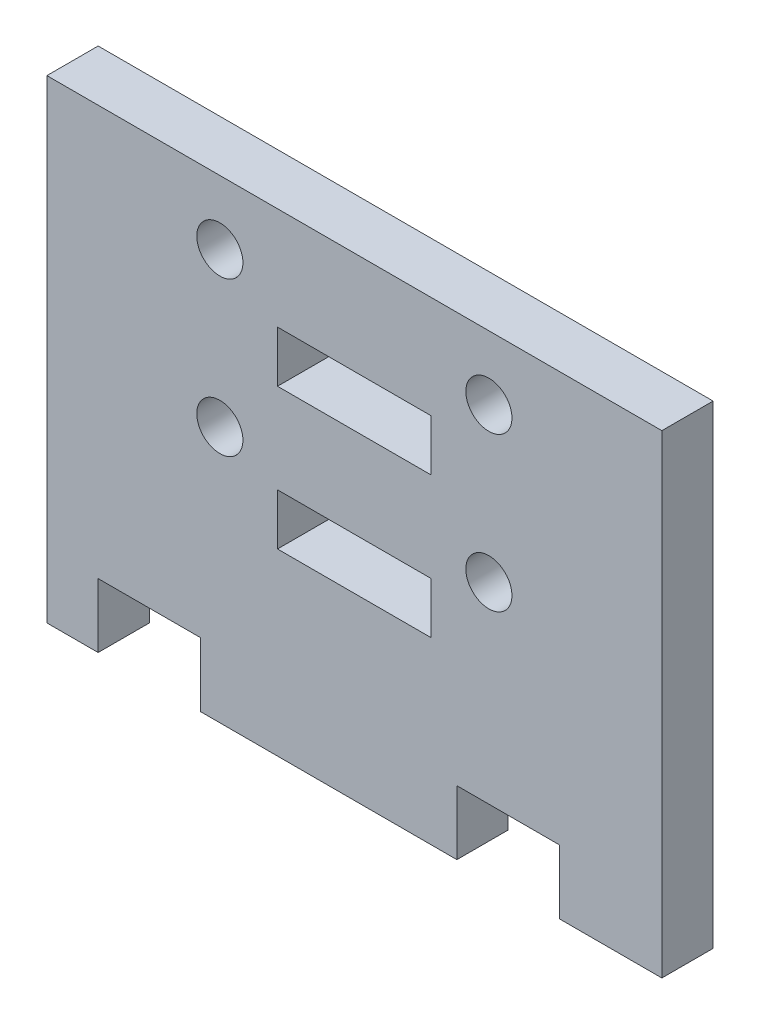
ISO-10303-21;
HEADER;
FILE_DESCRIPTION(('STEP AP214'),'2;1');
FILE_NAME('part.step','',(''),(''),'','','');
FILE_SCHEMA(('AUTOMOTIVE_DESIGN { 1 0 10303 214 1 1 1 1 }'));
ENDSEC;
DATA;
#1=APPLICATION_CONTEXT('core data for automotive mechanical design processes');
#2=APPLICATION_PROTOCOL_DEFINITION('international standard','automotive_design',2000,#1);
#3=PRODUCT_CONTEXT('',#1,'mechanical');
#4=PRODUCT('Part','Part','',(#3));
#5=PRODUCT_RELATED_PRODUCT_CATEGORY('part','',(#4));
#6=PRODUCT_DEFINITION_FORMATION('','',#4);
#7=PRODUCT_DEFINITION_CONTEXT('part definition',#1,'design');
#8=PRODUCT_DEFINITION('design','',#6,#7);
#9=PRODUCT_DEFINITION_SHAPE('','',#8);
#10=(LENGTH_UNIT() NAMED_UNIT(*) SI_UNIT(.MILLI.,.METRE.));
#11=(NAMED_UNIT(*) PLANE_ANGLE_UNIT() SI_UNIT($,.RADIAN.));
#12=(NAMED_UNIT(*) SI_UNIT($,.STERADIAN.) SOLID_ANGLE_UNIT());
#13=UNCERTAINTY_MEASURE_WITH_UNIT(LENGTH_MEASURE(1.E-05),#10,'distance_accuracy_value','');
#14=(GEOMETRIC_REPRESENTATION_CONTEXT(3) GLOBAL_UNCERTAINTY_ASSIGNED_CONTEXT((#13)) GLOBAL_UNIT_ASSIGNED_CONTEXT((#10,
#11,#12)) REPRESENTATION_CONTEXT('',''));
#15=CARTESIAN_POINT('',(0.,0.,0.));
#16=DIRECTION('',(0.,0.,1.));
#17=DIRECTION('',(1.,0.,0.));
#18=AXIS2_PLACEMENT_3D('',#15,#16,#17);
#19=CARTESIAN_POINT('',(0.,0.,2.));
#20=DIRECTION('',(0.,0.,1.));
#21=DIRECTION('',(1.,0.,0.));
#22=AXIS2_PLACEMENT_3D('',#19,#20,#21);
#23=PLANE('',#22);
#24=DIRECTION('',(0.,-1.,0.));
#25=VECTOR('',#24,1.);
#26=CARTESIAN_POINT('',(52.2400519454897,7.,2.));
#27=LINE('',#26,#25);
#28=CARTESIAN_POINT('',(52.2400519454897,9.,2.));
#29=VERTEX_POINT('',#28);
#30=CARTESIAN_POINT('',(52.2400519454897,7.,2.));
#31=VERTEX_POINT('',#30);
#32=EDGE_CURVE('E207',#29,#31,#27,.T.);
#33=ORIENTED_EDGE('',*,*,#32,.F.);
#34=DIRECTION('',(-1.,0.,0.));
#35=VECTOR('',#34,1.);
#36=CARTESIAN_POINT('',(52.2400519454897,9.,2.));
#37=LINE('',#36,#35);
#38=CARTESIAN_POINT('',(58.2400519454896,9.,2.));
#39=VERTEX_POINT('',#38);
#40=EDGE_CURVE('E205',#39,#29,#37,.T.);
#41=ORIENTED_EDGE('',*,*,#40,.F.);
#42=DIRECTION('',(0.,1.,0.));
#43=VECTOR('',#42,1.);
#44=CARTESIAN_POINT('',(58.2400519454896,9.,2.));
#45=LINE('',#44,#43);
#46=CARTESIAN_POINT('',(58.2400519454896,7.,2.));
#47=VERTEX_POINT('',#46);
#48=EDGE_CURVE('E213',#47,#39,#45,.T.);
#49=ORIENTED_EDGE('',*,*,#48,.F.);
#50=DIRECTION('',(1.,0.,0.));
#51=VECTOR('',#50,1.);
#52=CARTESIAN_POINT('',(58.2400519454896,7.,2.));
#53=LINE('',#52,#51);
#54=EDGE_CURVE('E210',#31,#47,#53,.T.);
#55=ORIENTED_EDGE('',*,*,#54,.F.);
#56=EDGE_LOOP('',(#33,#41,#49,#55));
#57=FACE_BOUND('',#56,.T.);
#58=CARTESIAN_POINT('',(49.9900519454897,10.,2.));
#59=DIRECTION('',(0.,0.,1.));
#60=DIRECTION('',(1.,0.,0.));
#61=AXIS2_PLACEMENT_3D('',#58,#59,#60);
#62=CIRCLE('',#61,0.900000000000004);
#63=CARTESIAN_POINT('',(50.8900519454897,10.,2.));
#64=VERTEX_POINT('',#63);
#65=EDGE_CURVE('E242',#64,#64,#62,.T.);
#66=ORIENTED_EDGE('',*,*,#65,.F.);
#67=EDGE_LOOP('',(#66));
#68=FACE_BOUND('',#67,.T.);
#69=CARTESIAN_POINT('',(60.4900519454897,9.99999999999999,2.));
#70=DIRECTION('',(0.,0.,1.));
#71=DIRECTION('',(-1.,0.,0.));
#72=AXIS2_PLACEMENT_3D('',#69,#70,#71);
#73=CIRCLE('',#72,0.900000000000004);
#74=CARTESIAN_POINT('',(59.5900519454896,9.99999999999999,2.));
#75=VERTEX_POINT('',#74);
#76=EDGE_CURVE('E254',#75,#75,#73,.T.);
#77=ORIENTED_EDGE('',*,*,#76,.F.);
#78=EDGE_LOOP('',(#77));
#79=FACE_BOUND('',#78,.T.);
#80=DIRECTION('',(0.,1.,0.));
#81=VECTOR('',#80,1.);
#82=CARTESIAN_POINT('',(59.2400519454897,0.,2.));
#83=LINE('',#82,#81);
#84=CARTESIAN_POINT('',(59.2400519454897,0.,2.));
#85=VERTEX_POINT('',#84);
#86=CARTESIAN_POINT('',(59.2400519454897,2.5,2.));
#87=VERTEX_POINT('',#86);
#88=EDGE_CURVE('E260',#85,#87,#83,.T.);
#89=ORIENTED_EDGE('',*,*,#88,.T.);
#90=DIRECTION('',(1.,0.,0.));
#91=VECTOR('',#90,1.);
#92=CARTESIAN_POINT('',(63.2400519454897,2.5,2.));
#93=LINE('',#92,#91);
#94=CARTESIAN_POINT('',(63.2400519454897,2.5,2.));
#95=VERTEX_POINT('',#94);
#96=EDGE_CURVE('E263',#87,#95,#93,.T.);
#97=ORIENTED_EDGE('',*,*,#96,.T.);
#98=DIRECTION('',(0.,-1.,0.));
#99=VECTOR('',#98,1.);
#100=CARTESIAN_POINT('',(63.2400519454897,2.5,2.));
#101=LINE('',#100,#99);
#102=CARTESIAN_POINT('',(63.2400519454897,0.,2.));
#103=VERTEX_POINT('',#102);
#104=EDGE_CURVE('E266',#95,#103,#101,.T.);
#105=ORIENTED_EDGE('',*,*,#104,.T.);
#106=DIRECTION('',(1.,0.,0.));
#107=VECTOR('',#106,1.);
#108=CARTESIAN_POINT('',(63.2400519454897,0.,2.));
#109=LINE('',#108,#107);
#110=CARTESIAN_POINT('',(67.2400519454897,0.,2.));
#111=VERTEX_POINT('',#110);
#112=EDGE_CURVE('E268',#103,#111,#109,.T.);
#113=ORIENTED_EDGE('',*,*,#112,.T.);
#114=DIRECTION('',(0.,1.,0.));
#115=VECTOR('',#114,1.);
#116=CARTESIAN_POINT('',(67.2400519454897,0.,2.));
#117=LINE('',#116,#115);
#118=CARTESIAN_POINT('',(67.2400519454897,18.5,2.));
#119=VERTEX_POINT('',#118);
#120=EDGE_CURVE('E270',#111,#119,#117,.T.);
#121=ORIENTED_EDGE('',*,*,#120,.T.);
#122=DIRECTION('',(-1.,0.,0.));
#123=VECTOR('',#122,1.);
#124=CARTESIAN_POINT('',(67.2400519454897,18.5,2.));
#125=LINE('',#124,#123);
#126=CARTESIAN_POINT('',(43.2400519454896,18.5,2.));
#127=VERTEX_POINT('',#126);
#128=EDGE_CURVE('E272',#119,#127,#125,.T.);
#129=ORIENTED_EDGE('',*,*,#128,.T.);
#130=DIRECTION('',(0.,-1.,0.));
#131=VECTOR('',#130,1.);
#132=CARTESIAN_POINT('',(43.2400519454896,0.,2.));
#133=LINE('',#132,#131);
#134=CARTESIAN_POINT('',(43.2400519454896,0.,2.));
#135=VERTEX_POINT('',#134);
#136=EDGE_CURVE('E274',#127,#135,#133,.T.);
#137=ORIENTED_EDGE('',*,*,#136,.T.);
#138=DIRECTION('',(1.,0.,0.));
#139=VECTOR('',#138,1.);
#140=CARTESIAN_POINT('',(45.2400519454896,0.,2.));
#141=LINE('',#140,#139);
#142=CARTESIAN_POINT('',(45.2400519454896,0.,2.));
#143=VERTEX_POINT('',#142);
#144=EDGE_CURVE('E276',#135,#143,#141,.T.);
#145=ORIENTED_EDGE('',*,*,#144,.T.);
#146=DIRECTION('',(0.,1.,0.));
#147=VECTOR('',#146,1.);
#148=CARTESIAN_POINT('',(45.2400519454896,2.5,2.));
#149=LINE('',#148,#147);
#150=CARTESIAN_POINT('',(45.2400519454896,2.5,2.));
#151=VERTEX_POINT('',#150);
#152=EDGE_CURVE('E278',#143,#151,#149,.T.);
#153=ORIENTED_EDGE('',*,*,#152,.T.);
#154=DIRECTION('',(1.,0.,0.));
#155=VECTOR('',#154,1.);
#156=CARTESIAN_POINT('',(49.2400519454896,2.5,2.));
#157=LINE('',#156,#155);
#158=CARTESIAN_POINT('',(49.2400519454896,2.5,2.));
#159=VERTEX_POINT('',#158);
#160=EDGE_CURVE('E280',#151,#159,#157,.T.);
#161=ORIENTED_EDGE('',*,*,#160,.T.);
#162=DIRECTION('',(0.,-1.,0.));
#163=VECTOR('',#162,1.);
#164=CARTESIAN_POINT('',(49.2400519454896,0.,2.));
#165=LINE('',#164,#163);
#166=CARTESIAN_POINT('',(49.2400519454896,0.,2.));
#167=VERTEX_POINT('',#166);
#168=EDGE_CURVE('E282',#159,#167,#165,.T.);
#169=ORIENTED_EDGE('',*,*,#168,.T.);
#170=DIRECTION('',(1.,0.,0.));
#171=VECTOR('',#170,1.);
#172=CARTESIAN_POINT('',(59.2400519454897,0.,2.));
#173=LINE('',#172,#171);
#174=EDGE_CURVE('E284',#167,#85,#173,.T.);
#175=ORIENTED_EDGE('',*,*,#174,.T.);
#176=EDGE_LOOP('',(#89,#97,#105,#113,#121,#129,#137,#145,#153,#161,#169,#175));
#177=FACE_BOUND('',#176,.T.);
#178=CARTESIAN_POINT('',(49.9900519454897,16.,2.));
#179=DIRECTION('',(0.,0.,1.));
#180=DIRECTION('',(1.,0.,0.));
#181=AXIS2_PLACEMENT_3D('',#178,#179,#180);
#182=CIRCLE('',#181,0.900000000000004);
#183=CARTESIAN_POINT('',(50.8900519454897,16.,2.));
#184=VERTEX_POINT('',#183);
#185=EDGE_CURVE('E248',#184,#184,#182,.T.);
#186=ORIENTED_EDGE('',*,*,#185,.F.);
#187=EDGE_LOOP('',(#186));
#188=FACE_BOUND('',#187,.T.);
#189=CARTESIAN_POINT('',(60.4900519454897,16.,2.));
#190=DIRECTION('',(0.,0.,1.));
#191=DIRECTION('',(-1.,0.,0.));
#192=AXIS2_PLACEMENT_3D('',#189,#190,#191);
#193=CIRCLE('',#192,0.900000000000004);
#194=CARTESIAN_POINT('',(59.5900519454896,16.,2.));
#195=VERTEX_POINT('',#194);
#196=EDGE_CURVE('E236',#195,#195,#193,.T.);
#197=ORIENTED_EDGE('',*,*,#196,.F.);
#198=EDGE_LOOP('',(#197));
#199=FACE_BOUND('',#198,.T.);
#200=DIRECTION('',(0.,1.,0.));
#201=VECTOR('',#200,1.);
#202=CARTESIAN_POINT('',(58.2400519454896,14.5,2.));
#203=LINE('',#202,#201);
#204=CARTESIAN_POINT('',(58.2400519454896,12.5,2.));
#205=VERTEX_POINT('',#204);
#206=CARTESIAN_POINT('',(58.2400519454896,14.5,2.));
#207=VERTEX_POINT('',#206);
#208=EDGE_CURVE('E177',#205,#207,#203,.T.);
#209=ORIENTED_EDGE('',*,*,#208,.F.);
#210=DIRECTION('',(1.,0.,0.));
#211=VECTOR('',#210,1.);
#212=CARTESIAN_POINT('',(58.2400519454896,12.5,2.));
#213=LINE('',#212,#211);
#214=CARTESIAN_POINT('',(52.2400519454897,12.5,2.));
#215=VERTEX_POINT('',#214);
#216=EDGE_CURVE('E169',#215,#205,#213,.T.);
#217=ORIENTED_EDGE('',*,*,#216,.F.);
#218=DIRECTION('',(0.,-1.,0.));
#219=VECTOR('',#218,1.);
#220=CARTESIAN_POINT('',(52.2400519454897,12.5,2.));
#221=LINE('',#220,#219);
#222=CARTESIAN_POINT('',(52.2400519454897,14.5,2.));
#223=VERTEX_POINT('',#222);
#224=EDGE_CURVE('E191',#223,#215,#221,.T.);
#225=ORIENTED_EDGE('',*,*,#224,.F.);
#226=DIRECTION('',(-1.,0.,0.));
#227=VECTOR('',#226,1.);
#228=CARTESIAN_POINT('',(52.2400519454897,14.5,2.));
#229=LINE('',#228,#227);
#230=EDGE_CURVE('E189',#207,#223,#229,.T.);
#231=ORIENTED_EDGE('',*,*,#230,.F.);
#232=EDGE_LOOP('',(#209,#217,#225,#231));
#233=FACE_BOUND('',#232,.T.);
#234=ADVANCED_FACE('F32',(#57,#68,#79,#177,#188,#199,#233),#23,.T.);
#235=CARTESIAN_POINT('',(0.,0.,0.));
#236=DIRECTION('',(0.,0.,1.));
#237=DIRECTION('',(1.,0.,0.));
#238=AXIS2_PLACEMENT_3D('',#235,#236,#237);
#239=PLANE('',#238);
#240=DIRECTION('',(-1.,0.,0.));
#241=VECTOR('',#240,1.);
#242=CARTESIAN_POINT('',(52.2400519454897,9.,0.));
#243=LINE('',#242,#241);
#244=CARTESIAN_POINT('',(58.2400519454896,9.,0.));
#245=VERTEX_POINT('',#244);
#246=CARTESIAN_POINT('',(52.2400519454897,9.,0.));
#247=VERTEX_POINT('',#246);
#248=EDGE_CURVE('E185',#245,#247,#243,.T.);
#249=ORIENTED_EDGE('',*,*,#248,.T.);
#250=DIRECTION('',(0.,-1.,0.));
#251=VECTOR('',#250,1.);
#252=CARTESIAN_POINT('',(52.2400519454897,7.,0.));
#253=LINE('',#252,#251);
#254=CARTESIAN_POINT('',(52.2400519454897,7.,0.));
#255=VERTEX_POINT('',#254);
#256=EDGE_CURVE('E218',#247,#255,#253,.T.);
#257=ORIENTED_EDGE('',*,*,#256,.T.);
#258=DIRECTION('',(1.,0.,0.));
#259=VECTOR('',#258,1.);
#260=CARTESIAN_POINT('',(58.2400519454896,7.,0.));
#261=LINE('',#260,#259);
#262=CARTESIAN_POINT('',(58.2400519454896,7.,0.));
#263=VERTEX_POINT('',#262);
#264=EDGE_CURVE('E221',#255,#263,#261,.T.);
#265=ORIENTED_EDGE('',*,*,#264,.T.);
#266=DIRECTION('',(0.,1.,0.));
#267=VECTOR('',#266,1.);
#268=CARTESIAN_POINT('',(58.2400519454896,9.,0.));
#269=LINE('',#268,#267);
#270=EDGE_CURVE('E208',#263,#245,#269,.T.);
#271=ORIENTED_EDGE('',*,*,#270,.T.);
#272=EDGE_LOOP('',(#249,#257,#265,#271));
#273=FACE_BOUND('',#272,.T.);
#274=CARTESIAN_POINT('',(49.9900519454897,10.,0.));
#275=DIRECTION('',(0.,0.,1.));
#276=DIRECTION('',(1.,0.,0.));
#277=AXIS2_PLACEMENT_3D('',#274,#275,#276);
#278=CIRCLE('',#277,0.900000000000004);
#279=CARTESIAN_POINT('',(50.8900519454897,10.,0.));
#280=VERTEX_POINT('',#279);
#281=EDGE_CURVE('E239',#280,#280,#278,.T.);
#282=ORIENTED_EDGE('',*,*,#281,.T.);
#283=EDGE_LOOP('',(#282));
#284=FACE_BOUND('',#283,.T.);
#285=CARTESIAN_POINT('',(60.4900519454897,9.99999999999999,0.));
#286=DIRECTION('',(0.,0.,1.));
#287=DIRECTION('',(-1.,0.,0.));
#288=AXIS2_PLACEMENT_3D('',#285,#286,#287);
#289=CIRCLE('',#288,0.900000000000004);
#290=CARTESIAN_POINT('',(59.5900519454896,9.99999999999999,0.));
#291=VERTEX_POINT('',#290);
#292=EDGE_CURVE('E251',#291,#291,#289,.T.);
#293=ORIENTED_EDGE('',*,*,#292,.T.);
#294=EDGE_LOOP('',(#293));
#295=FACE_BOUND('',#294,.T.);
#296=DIRECTION('',(0.,1.,0.));
#297=VECTOR('',#296,1.);
#298=CARTESIAN_POINT('',(59.2400519454897,0.,0.));
#299=LINE('',#298,#297);
#300=CARTESIAN_POINT('',(59.2400519454897,0.,0.));
#301=VERTEX_POINT('',#300);
#302=CARTESIAN_POINT('',(59.2400519454897,2.5,0.));
#303=VERTEX_POINT('',#302);
#304=EDGE_CURVE('E257',#301,#303,#299,.T.);
#305=ORIENTED_EDGE('',*,*,#304,.F.);
#306=DIRECTION('',(1.,0.,0.));
#307=VECTOR('',#306,1.);
#308=CARTESIAN_POINT('',(59.2400519454897,0.,0.));
#309=LINE('',#308,#307);
#310=CARTESIAN_POINT('',(49.2400519454896,0.,0.));
#311=VERTEX_POINT('',#310);
#312=EDGE_CURVE('E264',#311,#301,#309,.T.);
#313=ORIENTED_EDGE('',*,*,#312,.F.);
#314=DIRECTION('',(0.,-1.,0.));
#315=VECTOR('',#314,1.);
#316=CARTESIAN_POINT('',(49.2400519454896,0.,0.));
#317=LINE('',#316,#315);
#318=CARTESIAN_POINT('',(49.2400519454896,2.5,0.));
#319=VERTEX_POINT('',#318);
#320=EDGE_CURVE('E307',#319,#311,#317,.T.);
#321=ORIENTED_EDGE('',*,*,#320,.F.);
#322=DIRECTION('',(1.,0.,0.));
#323=VECTOR('',#322,1.);
#324=CARTESIAN_POINT('',(49.2400519454896,2.5,0.));
#325=LINE('',#324,#323);
#326=CARTESIAN_POINT('',(45.2400519454896,2.5,0.));
#327=VERTEX_POINT('',#326);
#328=EDGE_CURVE('E305',#327,#319,#325,.T.);
#329=ORIENTED_EDGE('',*,*,#328,.F.);
#330=DIRECTION('',(0.,1.,0.));
#331=VECTOR('',#330,1.);
#332=CARTESIAN_POINT('',(45.2400519454896,2.5,0.));
#333=LINE('',#332,#331);
#334=CARTESIAN_POINT('',(45.2400519454896,0.,0.));
#335=VERTEX_POINT('',#334);
#336=EDGE_CURVE('E303',#335,#327,#333,.T.);
#337=ORIENTED_EDGE('',*,*,#336,.F.);
#338=DIRECTION('',(1.,0.,0.));
#339=VECTOR('',#338,1.);
#340=CARTESIAN_POINT('',(45.2400519454896,0.,0.));
#341=LINE('',#340,#339);
#342=CARTESIAN_POINT('',(43.2400519454896,0.,0.));
#343=VERTEX_POINT('',#342);
#344=EDGE_CURVE('E301',#343,#335,#341,.T.);
#345=ORIENTED_EDGE('',*,*,#344,.F.);
#346=DIRECTION('',(0.,-1.,0.));
#347=VECTOR('',#346,1.);
#348=CARTESIAN_POINT('',(43.2400519454896,0.,0.));
#349=LINE('',#348,#347);
#350=CARTESIAN_POINT('',(43.2400519454896,18.5,0.));
#351=VERTEX_POINT('',#350);
#352=EDGE_CURVE('E299',#351,#343,#349,.T.);
#353=ORIENTED_EDGE('',*,*,#352,.F.);
#354=DIRECTION('',(-1.,0.,0.));
#355=VECTOR('',#354,1.);
#356=CARTESIAN_POINT('',(67.2400519454897,18.5,0.));
#357=LINE('',#356,#355);
#358=CARTESIAN_POINT('',(67.2400519454897,18.5,0.));
#359=VERTEX_POINT('',#358);
#360=EDGE_CURVE('E297',#359,#351,#357,.T.);
#361=ORIENTED_EDGE('',*,*,#360,.F.);
#362=DIRECTION('',(0.,1.,0.));
#363=VECTOR('',#362,1.);
#364=CARTESIAN_POINT('',(67.2400519454897,0.,0.));
#365=LINE('',#364,#363);
#366=CARTESIAN_POINT('',(67.2400519454897,0.,0.));
#367=VERTEX_POINT('',#366);
#368=EDGE_CURVE('E295',#367,#359,#365,.T.);
#369=ORIENTED_EDGE('',*,*,#368,.F.);
#370=DIRECTION('',(1.,0.,0.));
#371=VECTOR('',#370,1.);
#372=CARTESIAN_POINT('',(63.2400519454897,0.,0.));
#373=LINE('',#372,#371);
#374=CARTESIAN_POINT('',(63.2400519454897,0.,0.));
#375=VERTEX_POINT('',#374);
#376=EDGE_CURVE('E293',#375,#367,#373,.T.);
#377=ORIENTED_EDGE('',*,*,#376,.F.);
#378=DIRECTION('',(0.,-1.,0.));
#379=VECTOR('',#378,1.);
#380=CARTESIAN_POINT('',(63.2400519454897,2.5,0.));
#381=LINE('',#380,#379);
#382=CARTESIAN_POINT('',(63.2400519454897,2.5,0.));
#383=VERTEX_POINT('',#382);
#384=EDGE_CURVE('E291',#383,#375,#381,.T.);
#385=ORIENTED_EDGE('',*,*,#384,.F.);
#386=DIRECTION('',(1.,0.,0.));
#387=VECTOR('',#386,1.);
#388=CARTESIAN_POINT('',(63.2400519454897,2.5,0.));
#389=LINE('',#388,#387);
#390=EDGE_CURVE('E289',#303,#383,#389,.T.);
#391=ORIENTED_EDGE('',*,*,#390,.F.);
#392=EDGE_LOOP('',(#305,#313,#321,#329,#337,#345,#353,#361,#369,#377,#385,#391));
#393=FACE_BOUND('',#392,.T.);
#394=CARTESIAN_POINT('',(49.9900519454897,16.,0.));
#395=DIRECTION('',(0.,0.,1.));
#396=DIRECTION('',(1.,0.,0.));
#397=AXIS2_PLACEMENT_3D('',#394,#395,#396);
#398=CIRCLE('',#397,0.900000000000004);
#399=CARTESIAN_POINT('',(50.8900519454897,16.,0.));
#400=VERTEX_POINT('',#399);
#401=EDGE_CURVE('E245',#400,#400,#398,.T.);
#402=ORIENTED_EDGE('',*,*,#401,.T.);
#403=EDGE_LOOP('',(#402));
#404=FACE_BOUND('',#403,.T.);
#405=CARTESIAN_POINT('',(60.4900519454897,16.,0.));
#406=DIRECTION('',(0.,0.,1.));
#407=DIRECTION('',(-1.,0.,0.));
#408=AXIS2_PLACEMENT_3D('',#405,#406,#407);
#409=CIRCLE('',#408,0.900000000000004);
#410=CARTESIAN_POINT('',(59.5900519454896,16.,0.));
#411=VERTEX_POINT('',#410);
#412=EDGE_CURVE('E235',#411,#411,#409,.T.);
#413=ORIENTED_EDGE('',*,*,#412,.T.);
#414=EDGE_LOOP('',(#413));
#415=FACE_BOUND('',#414,.T.);
#416=DIRECTION('',(1.,0.,0.));
#417=VECTOR('',#416,1.);
#418=CARTESIAN_POINT('',(58.2400519454896,12.5,0.));
#419=LINE('',#418,#417);
#420=CARTESIAN_POINT('',(52.2400519454897,12.5,0.));
#421=VERTEX_POINT('',#420);
#422=CARTESIAN_POINT('',(58.2400519454896,12.5,0.));
#423=VERTEX_POINT('',#422);
#424=EDGE_CURVE('E55',#421,#423,#419,.T.);
#425=ORIENTED_EDGE('',*,*,#424,.T.);
#426=DIRECTION('',(0.,1.,0.));
#427=VECTOR('',#426,1.);
#428=CARTESIAN_POINT('',(58.2400519454896,14.5,0.));
#429=LINE('',#428,#427);
#430=CARTESIAN_POINT('',(58.2400519454896,14.5,0.));
#431=VERTEX_POINT('',#430);
#432=EDGE_CURVE('E184',#423,#431,#429,.T.);
#433=ORIENTED_EDGE('',*,*,#432,.T.);
#434=DIRECTION('',(-1.,0.,0.));
#435=VECTOR('',#434,1.);
#436=CARTESIAN_POINT('',(52.2400519454897,14.5,0.));
#437=LINE('',#436,#435);
#438=CARTESIAN_POINT('',(52.2400519454897,14.5,0.));
#439=VERTEX_POINT('',#438);
#440=EDGE_CURVE('E197',#431,#439,#437,.T.);
#441=ORIENTED_EDGE('',*,*,#440,.T.);
#442=DIRECTION('',(0.,-1.,0.));
#443=VECTOR('',#442,1.);
#444=CARTESIAN_POINT('',(52.2400519454897,12.5,0.));
#445=LINE('',#444,#443);
#446=EDGE_CURVE('E178',#439,#421,#445,.T.);
#447=ORIENTED_EDGE('',*,*,#446,.T.);
#448=EDGE_LOOP('',(#425,#433,#441,#447));
#449=FACE_BOUND('',#448,.T.);
#450=ADVANCED_FACE('F349',(#273,#284,#295,#393,#404,#415,#449),#239,.F.);
#451=CARTESIAN_POINT('',(59.2400519454897,0.,2.));
#452=DIRECTION('',(-1.,0.,0.));
#453=DIRECTION('',(0.,0.,1.));
#454=AXIS2_PLACEMENT_3D('',#451,#452,#453);
#455=PLANE('',#454);
#456=ORIENTED_EDGE('',*,*,#304,.T.);
#457=DIRECTION('',(0.,0.,-1.));
#458=VECTOR('',#457,1.);
#459=CARTESIAN_POINT('',(59.2400519454897,2.5,2.));
#460=LINE('',#459,#458);
#461=EDGE_CURVE('E11',#87,#303,#460,.T.);
#462=ORIENTED_EDGE('',*,*,#461,.F.);
#463=ORIENTED_EDGE('',*,*,#88,.F.);
#464=DIRECTION('',(0.,0.,-1.));
#465=VECTOR('',#464,1.);
#466=CARTESIAN_POINT('',(59.2400519454897,0.,2.));
#467=LINE('',#466,#465);
#468=EDGE_CURVE('E286',#85,#301,#467,.T.);
#469=ORIENTED_EDGE('',*,*,#468,.T.);
#470=EDGE_LOOP('',(#456,#462,#463,#469));
#471=FACE_BOUND('',#470,.T.);
#472=ADVANCED_FACE('F34',(#471),#455,.F.);
#473=CARTESIAN_POINT('',(63.2400519454897,2.5,2.));
#474=DIRECTION('',(0.,1.,0.));
#475=DIRECTION('',(-1.,0.,0.));
#476=AXIS2_PLACEMENT_3D('',#473,#474,#475);
#477=PLANE('',#476);
#478=ORIENTED_EDGE('',*,*,#390,.T.);
#479=DIRECTION('',(0.,0.,-1.));
#480=VECTOR('',#479,1.);
#481=CARTESIAN_POINT('',(63.2400519454897,2.5,2.));
#482=LINE('',#481,#480);
#483=EDGE_CURVE('E40',#95,#383,#482,.T.);
#484=ORIENTED_EDGE('',*,*,#483,.F.);
#485=ORIENTED_EDGE('',*,*,#96,.F.);
#486=ORIENTED_EDGE('',*,*,#461,.T.);
#487=EDGE_LOOP('',(#478,#484,#485,#486));
#488=FACE_BOUND('',#487,.T.);
#489=ADVANCED_FACE('F367',(#488),#477,.F.);
#490=CARTESIAN_POINT('',(63.2400519454897,2.5,2.));
#491=DIRECTION('',(1.,0.,0.));
#492=DIRECTION('',(0.,0.,-1.));
#493=AXIS2_PLACEMENT_3D('',#490,#491,#492);
#494=PLANE('',#493);
#495=ORIENTED_EDGE('',*,*,#384,.T.);
#496=DIRECTION('',(0.,0.,-1.));
#497=VECTOR('',#496,1.);
#498=CARTESIAN_POINT('',(63.2400519454897,0.,2.));
#499=LINE('',#498,#497);
#500=EDGE_CURVE('E336',#103,#375,#499,.T.);
#501=ORIENTED_EDGE('',*,*,#500,.F.);
#502=ORIENTED_EDGE('',*,*,#104,.F.);
#503=ORIENTED_EDGE('',*,*,#483,.T.);
#504=EDGE_LOOP('',(#495,#501,#502,#503));
#505=FACE_BOUND('',#504,.T.);
#506=ADVANCED_FACE('F343',(#505),#494,.F.);
#507=CARTESIAN_POINT('',(63.2400519454897,0.,2.));
#508=DIRECTION('',(0.,1.,0.));
#509=DIRECTION('',(-1.,0.,0.));
#510=AXIS2_PLACEMENT_3D('',#507,#508,#509);
#511=PLANE('',#510);
#512=ORIENTED_EDGE('',*,*,#376,.T.);
#513=DIRECTION('',(0.,0.,-1.));
#514=VECTOR('',#513,1.);
#515=CARTESIAN_POINT('',(67.2400519454897,0.,2.));
#516=LINE('',#515,#514);
#517=EDGE_CURVE('E333',#111,#367,#516,.T.);
#518=ORIENTED_EDGE('',*,*,#517,.F.);
#519=ORIENTED_EDGE('',*,*,#112,.F.);
#520=ORIENTED_EDGE('',*,*,#500,.T.);
#521=EDGE_LOOP('',(#512,#518,#519,#520));
#522=FACE_BOUND('',#521,.T.);
#523=ADVANCED_FACE('F355',(#522),#511,.F.);
#524=CARTESIAN_POINT('',(67.2400519454897,0.,2.));
#525=DIRECTION('',(-1.,0.,0.));
#526=DIRECTION('',(0.,0.,1.));
#527=AXIS2_PLACEMENT_3D('',#524,#525,#526);
#528=PLANE('',#527);
#529=ORIENTED_EDGE('',*,*,#368,.T.);
#530=DIRECTION('',(0.,0.,-1.));
#531=VECTOR('',#530,1.);
#532=CARTESIAN_POINT('',(67.2400519454897,18.5,2.));
#533=LINE('',#532,#531);
#534=EDGE_CURVE('E330',#119,#359,#533,.T.);
#535=ORIENTED_EDGE('',*,*,#534,.F.);
#536=ORIENTED_EDGE('',*,*,#120,.F.);
#537=ORIENTED_EDGE('',*,*,#517,.T.);
#538=EDGE_LOOP('',(#529,#535,#536,#537));
#539=FACE_BOUND('',#538,.T.);
#540=ADVANCED_FACE('F359',(#539),#528,.F.);
#541=CARTESIAN_POINT('',(67.2400519454897,18.5,2.));
#542=DIRECTION('',(0.,-1.,0.));
#543=DIRECTION('',(0.,0.,-1.));
#544=AXIS2_PLACEMENT_3D('',#541,#542,#543);
#545=PLANE('',#544);
#546=ORIENTED_EDGE('',*,*,#360,.T.);
#547=DIRECTION('',(0.,0.,-1.));
#548=VECTOR('',#547,1.);
#549=CARTESIAN_POINT('',(43.2400519454896,18.5,2.));
#550=LINE('',#549,#548);
#551=EDGE_CURVE('E327',#127,#351,#550,.T.);
#552=ORIENTED_EDGE('',*,*,#551,.F.);
#553=ORIENTED_EDGE('',*,*,#128,.F.);
#554=ORIENTED_EDGE('',*,*,#534,.T.);
#555=EDGE_LOOP('',(#546,#552,#553,#554));
#556=FACE_BOUND('',#555,.T.);
#557=ADVANCED_FACE('F400',(#556),#545,.F.);
#558=CARTESIAN_POINT('',(43.2400519454896,0.,2.));
#559=DIRECTION('',(1.,0.,0.));
#560=DIRECTION('',(0.,0.,-1.));
#561=AXIS2_PLACEMENT_3D('',#558,#559,#560);
#562=PLANE('',#561);
#563=ORIENTED_EDGE('',*,*,#352,.T.);
#564=DIRECTION('',(0.,0.,-1.));
#565=VECTOR('',#564,1.);
#566=CARTESIAN_POINT('',(43.2400519454896,0.,2.));
#567=LINE('',#566,#565);
#568=EDGE_CURVE('E324',#135,#343,#567,.T.);
#569=ORIENTED_EDGE('',*,*,#568,.F.);
#570=ORIENTED_EDGE('',*,*,#136,.F.);
#571=ORIENTED_EDGE('',*,*,#551,.T.);
#572=EDGE_LOOP('',(#563,#569,#570,#571));
#573=FACE_BOUND('',#572,.T.);
#574=ADVANCED_FACE('F398',(#573),#562,.F.);
#575=CARTESIAN_POINT('',(45.2400519454896,0.,2.));
#576=DIRECTION('',(0.,1.,0.));
#577=DIRECTION('',(0.,0.,1.));
#578=AXIS2_PLACEMENT_3D('',#575,#576,#577);
#579=PLANE('',#578);
#580=ORIENTED_EDGE('',*,*,#344,.T.);
#581=DIRECTION('',(0.,0.,-1.));
#582=VECTOR('',#581,1.);
#583=CARTESIAN_POINT('',(45.2400519454896,0.,2.));
#584=LINE('',#583,#582);
#585=EDGE_CURVE('E321',#143,#335,#584,.T.);
#586=ORIENTED_EDGE('',*,*,#585,.F.);
#587=ORIENTED_EDGE('',*,*,#144,.F.);
#588=ORIENTED_EDGE('',*,*,#568,.T.);
#589=EDGE_LOOP('',(#580,#586,#587,#588));
#590=FACE_BOUND('',#589,.T.);
#591=ADVANCED_FACE('F394',(#590),#579,.F.);
#592=CARTESIAN_POINT('',(45.2400519454896,2.5,2.));
#593=DIRECTION('',(-1.,0.,0.));
#594=DIRECTION('',(0.,-1.,0.));
#595=AXIS2_PLACEMENT_3D('',#592,#593,#594);
#596=PLANE('',#595);
#597=ORIENTED_EDGE('',*,*,#336,.T.);
#598=DIRECTION('',(0.,0.,-1.));
#599=VECTOR('',#598,1.);
#600=CARTESIAN_POINT('',(45.2400519454896,2.5,2.));
#601=LINE('',#600,#599);
#602=EDGE_CURVE('E318',#151,#327,#601,.T.);
#603=ORIENTED_EDGE('',*,*,#602,.F.);
#604=ORIENTED_EDGE('',*,*,#152,.F.);
#605=ORIENTED_EDGE('',*,*,#585,.T.);
#606=EDGE_LOOP('',(#597,#603,#604,#605));
#607=FACE_BOUND('',#606,.T.);
#608=ADVANCED_FACE('F389',(#607),#596,.F.);
#609=CARTESIAN_POINT('',(49.2400519454896,2.5,2.));
#610=DIRECTION('',(0.,1.,0.));
#611=DIRECTION('',(-1.,0.,0.));
#612=AXIS2_PLACEMENT_3D('',#609,#610,#611);
#613=PLANE('',#612);
#614=ORIENTED_EDGE('',*,*,#328,.T.);
#615=DIRECTION('',(0.,0.,-1.));
#616=VECTOR('',#615,1.);
#617=CARTESIAN_POINT('',(49.2400519454896,2.5,2.));
#618=LINE('',#617,#616);
#619=EDGE_CURVE('E315',#159,#319,#618,.T.);
#620=ORIENTED_EDGE('',*,*,#619,.F.);
#621=ORIENTED_EDGE('',*,*,#160,.F.);
#622=ORIENTED_EDGE('',*,*,#602,.T.);
#623=EDGE_LOOP('',(#614,#620,#621,#622));
#624=FACE_BOUND('',#623,.T.);
#625=ADVANCED_FACE('F383',(#624),#613,.F.);
#626=CARTESIAN_POINT('',(49.2400519454896,0.,2.));
#627=DIRECTION('',(1.,0.,0.));
#628=DIRECTION('',(0.,0.,-1.));
#629=AXIS2_PLACEMENT_3D('',#626,#627,#628);
#630=PLANE('',#629);
#631=ORIENTED_EDGE('',*,*,#320,.T.);
#632=DIRECTION('',(0.,0.,-1.));
#633=VECTOR('',#632,1.);
#634=CARTESIAN_POINT('',(49.2400519454896,0.,2.));
#635=LINE('',#634,#633);
#636=EDGE_CURVE('E312',#167,#311,#635,.T.);
#637=ORIENTED_EDGE('',*,*,#636,.F.);
#638=ORIENTED_EDGE('',*,*,#168,.F.);
#639=ORIENTED_EDGE('',*,*,#619,.T.);
#640=EDGE_LOOP('',(#631,#637,#638,#639));
#641=FACE_BOUND('',#640,.T.);
#642=ADVANCED_FACE('F379',(#641),#630,.F.);
#643=CARTESIAN_POINT('',(59.2400519454897,0.,2.));
#644=DIRECTION('',(0.,1.,0.));
#645=DIRECTION('',(-1.,0.,0.));
#646=AXIS2_PLACEMENT_3D('',#643,#644,#645);
#647=PLANE('',#646);
#648=ORIENTED_EDGE('',*,*,#312,.T.);
#649=ORIENTED_EDGE('',*,*,#468,.F.);
#650=ORIENTED_EDGE('',*,*,#174,.F.);
#651=ORIENTED_EDGE('',*,*,#636,.T.);
#652=EDGE_LOOP('',(#648,#649,#650,#651));
#653=FACE_BOUND('',#652,.T.);
#654=ADVANCED_FACE('F374',(#653),#647,.F.);
#655=CARTESIAN_POINT('',(60.4900519454897,9.99999999999999,2.));
#656=DIRECTION('',(0.,0.,-1.));
#657=DIRECTION('',(-1.,0.,0.));
#658=AXIS2_PLACEMENT_3D('',#655,#656,#657);
#659=CYLINDRICAL_SURFACE('',#658,0.900000000000004);
#660=ORIENTED_EDGE('',*,*,#76,.T.);
#661=EDGE_LOOP('',(#660));
#662=FACE_BOUND('',#661,.T.);
#663=ORIENTED_EDGE('',*,*,#292,.F.);
#664=EDGE_LOOP('',(#663));
#665=FACE_BOUND('',#664,.T.);
#666=ADVANCED_FACE('F420',(#662,#665),#659,.F.);
#667=CARTESIAN_POINT('',(49.9900519454897,16.,2.));
#668=DIRECTION('',(0.,0.,-1.));
#669=DIRECTION('',(-1.,0.,0.));
#670=AXIS2_PLACEMENT_3D('',#667,#668,#669);
#671=CYLINDRICAL_SURFACE('',#670,0.900000000000004);
#672=ORIENTED_EDGE('',*,*,#185,.T.);
#673=EDGE_LOOP('',(#672));
#674=FACE_BOUND('',#673,.T.);
#675=ORIENTED_EDGE('',*,*,#401,.F.);
#676=EDGE_LOOP('',(#675));
#677=FACE_BOUND('',#676,.T.);
#678=ADVANCED_FACE('F458',(#674,#677),#671,.F.);
#679=CARTESIAN_POINT('',(49.9900519454897,10.,2.));
#680=DIRECTION('',(0.,0.,-1.));
#681=DIRECTION('',(-1.,0.,0.));
#682=AXIS2_PLACEMENT_3D('',#679,#680,#681);
#683=CYLINDRICAL_SURFACE('',#682,0.900000000000004);
#684=ORIENTED_EDGE('',*,*,#65,.T.);
#685=EDGE_LOOP('',(#684));
#686=FACE_BOUND('',#685,.T.);
#687=ORIENTED_EDGE('',*,*,#281,.F.);
#688=EDGE_LOOP('',(#687));
#689=FACE_BOUND('',#688,.T.);
#690=ADVANCED_FACE('F465',(#686,#689),#683,.F.);
#691=CARTESIAN_POINT('',(60.4900519454897,16.,2.));
#692=DIRECTION('',(0.,0.,-1.));
#693=DIRECTION('',(-1.,0.,0.));
#694=AXIS2_PLACEMENT_3D('',#691,#692,#693);
#695=CYLINDRICAL_SURFACE('',#694,0.900000000000004);
#696=ORIENTED_EDGE('',*,*,#196,.T.);
#697=EDGE_LOOP('',(#696));
#698=FACE_BOUND('',#697,.T.);
#699=ORIENTED_EDGE('',*,*,#412,.F.);
#700=EDGE_LOOP('',(#699));
#701=FACE_BOUND('',#700,.T.);
#702=ADVANCED_FACE('F472',(#698,#701),#695,.F.);
#703=CARTESIAN_POINT('',(52.2400519454897,9.,2.));
#704=DIRECTION('',(0.,-1.,0.));
#705=DIRECTION('',(0.,0.,-1.));
#706=AXIS2_PLACEMENT_3D('',#703,#704,#705);
#707=PLANE('',#706);
#708=ORIENTED_EDGE('',*,*,#248,.F.);
#709=DIRECTION('',(0.,0.,-1.));
#710=VECTOR('',#709,1.);
#711=CARTESIAN_POINT('',(58.2400519454896,9.,2.));
#712=LINE('',#711,#710);
#713=EDGE_CURVE('E215',#39,#245,#712,.T.);
#714=ORIENTED_EDGE('',*,*,#713,.F.);
#715=ORIENTED_EDGE('',*,*,#40,.T.);
#716=DIRECTION('',(0.,0.,-1.));
#717=VECTOR('',#716,1.);
#718=CARTESIAN_POINT('',(52.2400519454897,9.,2.));
#719=LINE('',#718,#717);
#720=EDGE_CURVE('E232',#29,#247,#719,.T.);
#721=ORIENTED_EDGE('',*,*,#720,.T.);
#722=EDGE_LOOP('',(#708,#714,#715,#721));
#723=FACE_BOUND('',#722,.T.);
#724=ADVANCED_FACE('F480',(#723),#707,.T.);
#725=CARTESIAN_POINT('',(52.2400519454897,7.,2.));
#726=DIRECTION('',(1.,0.,0.));
#727=DIRECTION('',(0.,0.,-1.));
#728=AXIS2_PLACEMENT_3D('',#725,#726,#727);
#729=PLANE('',#728);
#730=ORIENTED_EDGE('',*,*,#256,.F.);
#731=ORIENTED_EDGE('',*,*,#720,.F.);
#732=ORIENTED_EDGE('',*,*,#32,.T.);
#733=DIRECTION('',(0.,0.,-1.));
#734=VECTOR('',#733,1.);
#735=CARTESIAN_POINT('',(52.2400519454897,7.,2.));
#736=LINE('',#735,#734);
#737=EDGE_CURVE('E230',#31,#255,#736,.T.);
#738=ORIENTED_EDGE('',*,*,#737,.T.);
#739=EDGE_LOOP('',(#730,#731,#732,#738));
#740=FACE_BOUND('',#739,.T.);
#741=ADVANCED_FACE('F488',(#740),#729,.T.);
#742=CARTESIAN_POINT('',(58.2400519454896,7.,2.));
#743=DIRECTION('',(0.,1.,0.));
#744=DIRECTION('',(0.,0.,1.));
#745=AXIS2_PLACEMENT_3D('',#742,#743,#744);
#746=PLANE('',#745);
#747=ORIENTED_EDGE('',*,*,#264,.F.);
#748=ORIENTED_EDGE('',*,*,#737,.F.);
#749=ORIENTED_EDGE('',*,*,#54,.T.);
#750=DIRECTION('',(0.,0.,-1.));
#751=VECTOR('',#750,1.);
#752=CARTESIAN_POINT('',(58.2400519454896,7.,2.));
#753=LINE('',#752,#751);
#754=EDGE_CURVE('E228',#47,#263,#753,.T.);
#755=ORIENTED_EDGE('',*,*,#754,.T.);
#756=EDGE_LOOP('',(#747,#748,#749,#755));
#757=FACE_BOUND('',#756,.T.);
#758=ADVANCED_FACE('F496',(#757),#746,.T.);
#759=CARTESIAN_POINT('',(58.2400519454896,9.,2.));
#760=DIRECTION('',(-1.,0.,0.));
#761=DIRECTION('',(0.,0.,1.));
#762=AXIS2_PLACEMENT_3D('',#759,#760,#761);
#763=PLANE('',#762);
#764=ORIENTED_EDGE('',*,*,#270,.F.);
#765=ORIENTED_EDGE('',*,*,#754,.F.);
#766=ORIENTED_EDGE('',*,*,#48,.T.);
#767=ORIENTED_EDGE('',*,*,#713,.T.);
#768=EDGE_LOOP('',(#764,#765,#766,#767));
#769=FACE_BOUND('',#768,.T.);
#770=ADVANCED_FACE('F504',(#769),#763,.T.);
#771=CARTESIAN_POINT('',(58.2400519454896,12.5,2.));
#772=DIRECTION('',(0.,1.,0.));
#773=DIRECTION('',(0.,0.,1.));
#774=AXIS2_PLACEMENT_3D('',#771,#772,#773);
#775=PLANE('',#774);
#776=ORIENTED_EDGE('',*,*,#424,.F.);
#777=DIRECTION('',(0.,0.,-1.));
#778=VECTOR('',#777,1.);
#779=CARTESIAN_POINT('',(52.2400519454897,12.5,2.));
#780=LINE('',#779,#778);
#781=EDGE_CURVE('E173',#215,#421,#780,.T.);
#782=ORIENTED_EDGE('',*,*,#781,.F.);
#783=ORIENTED_EDGE('',*,*,#216,.T.);
#784=DIRECTION('',(0.,0.,-1.));
#785=VECTOR('',#784,1.);
#786=CARTESIAN_POINT('',(58.2400519454896,12.5,2.));
#787=LINE('',#786,#785);
#788=EDGE_CURVE('E172',#205,#423,#787,.T.);
#789=ORIENTED_EDGE('',*,*,#788,.T.);
#790=EDGE_LOOP('',(#776,#782,#783,#789));
#791=FACE_BOUND('',#790,.T.);
#792=ADVANCED_FACE('F171',(#791),#775,.T.);
#793=CARTESIAN_POINT('',(58.2400519454896,14.5,2.));
#794=DIRECTION('',(-1.,0.,0.));
#795=DIRECTION('',(0.,0.,1.));
#796=AXIS2_PLACEMENT_3D('',#793,#794,#795);
#797=PLANE('',#796);
#798=ORIENTED_EDGE('',*,*,#432,.F.);
#799=ORIENTED_EDGE('',*,*,#788,.F.);
#800=ORIENTED_EDGE('',*,*,#208,.T.);
#801=DIRECTION('',(0.,0.,-1.));
#802=VECTOR('',#801,1.);
#803=CARTESIAN_POINT('',(58.2400519454896,14.5,2.));
#804=LINE('',#803,#802);
#805=EDGE_CURVE('E186',#207,#431,#804,.T.);
#806=ORIENTED_EDGE('',*,*,#805,.T.);
#807=EDGE_LOOP('',(#798,#799,#800,#806));
#808=FACE_BOUND('',#807,.T.);
#809=ADVANCED_FACE('F181',(#808),#797,.T.);
#810=CARTESIAN_POINT('',(52.2400519454897,14.5,2.));
#811=DIRECTION('',(0.,-1.,0.));
#812=DIRECTION('',(0.,0.,-1.));
#813=AXIS2_PLACEMENT_3D('',#810,#811,#812);
#814=PLANE('',#813);
#815=ORIENTED_EDGE('',*,*,#440,.F.);
#816=ORIENTED_EDGE('',*,*,#805,.F.);
#817=ORIENTED_EDGE('',*,*,#230,.T.);
#818=DIRECTION('',(0.,0.,-1.));
#819=VECTOR('',#818,1.);
#820=CARTESIAN_POINT('',(52.2400519454897,14.5,2.));
#821=LINE('',#820,#819);
#822=EDGE_CURVE('E47',#223,#439,#821,.T.);
#823=ORIENTED_EDGE('',*,*,#822,.T.);
#824=EDGE_LOOP('',(#815,#816,#817,#823));
#825=FACE_BOUND('',#824,.T.);
#826=ADVANCED_FACE('F525',(#825),#814,.T.);
#827=CARTESIAN_POINT('',(52.2400519454897,12.5,2.));
#828=DIRECTION('',(1.,0.,0.));
#829=DIRECTION('',(0.,0.,-1.));
#830=AXIS2_PLACEMENT_3D('',#827,#828,#829);
#831=PLANE('',#830);
#832=ORIENTED_EDGE('',*,*,#446,.F.);
#833=ORIENTED_EDGE('',*,*,#822,.F.);
#834=ORIENTED_EDGE('',*,*,#224,.T.);
#835=ORIENTED_EDGE('',*,*,#781,.T.);
#836=EDGE_LOOP('',(#832,#833,#834,#835));
#837=FACE_BOUND('',#836,.T.);
#838=ADVANCED_FACE('F532',(#837),#831,.T.);
#839=CLOSED_SHELL('',(#234,#450,#472,#489,#506,#523,#540,#557,#574,#591,#608,#625,#642,#654,
#666,#678,#690,#702,#724,#741,#758,#770,#792,#809,#826,#838));
#840=MANIFOLD_SOLID_BREP('B2',#839);
#841=ADVANCED_BREP_SHAPE_REPRESENTATION('',(#18,#840),#14);
#842=SHAPE_DEFINITION_REPRESENTATION(#9,#841);
ENDSEC;
END-ISO-10303-21;
